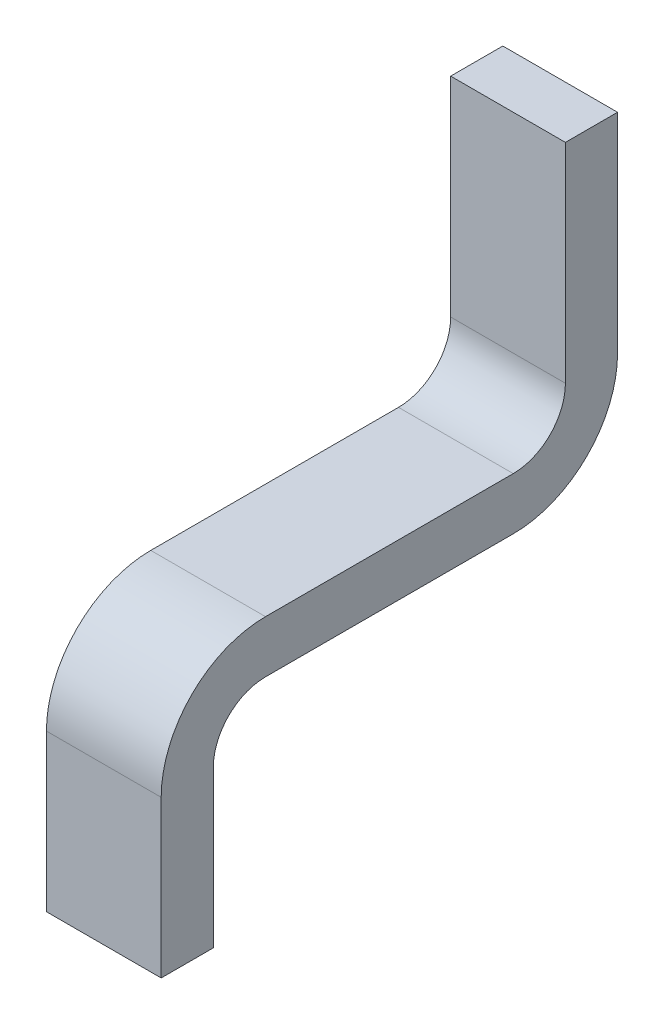
ISO-10303-21;
HEADER;
FILE_DESCRIPTION(('STEP AP214'),'2;1');
FILE_NAME('part.step','',(''),(''),'','','');
FILE_SCHEMA(('AUTOMOTIVE_DESIGN { 1 0 10303 214 1 1 1 1 }'));
ENDSEC;
DATA;
#1=APPLICATION_CONTEXT('core data for automotive mechanical design processes');
#2=APPLICATION_PROTOCOL_DEFINITION('international standard','automotive_design',2000,#1);
#3=PRODUCT_CONTEXT('',#1,'mechanical');
#4=PRODUCT('Part','Part','',(#3));
#5=PRODUCT_RELATED_PRODUCT_CATEGORY('part','',(#4));
#6=PRODUCT_DEFINITION_FORMATION('','',#4);
#7=PRODUCT_DEFINITION_CONTEXT('part definition',#1,'design');
#8=PRODUCT_DEFINITION('design','',#6,#7);
#9=PRODUCT_DEFINITION_SHAPE('','',#8);
#10=(LENGTH_UNIT() NAMED_UNIT(*) SI_UNIT(.MILLI.,.METRE.));
#11=(NAMED_UNIT(*) PLANE_ANGLE_UNIT() SI_UNIT($,.RADIAN.));
#12=(NAMED_UNIT(*) SI_UNIT($,.STERADIAN.) SOLID_ANGLE_UNIT());
#13=UNCERTAINTY_MEASURE_WITH_UNIT(LENGTH_MEASURE(1.E-05),#10,'distance_accuracy_value','');
#14=(GEOMETRIC_REPRESENTATION_CONTEXT(3) GLOBAL_UNCERTAINTY_ASSIGNED_CONTEXT((#13)) GLOBAL_UNIT_ASSIGNED_CONTEXT((#10,
#11,#12)) REPRESENTATION_CONTEXT('',''));
#15=CARTESIAN_POINT('',(0.,0.,0.));
#16=DIRECTION('',(0.,0.,1.));
#17=DIRECTION('',(1.,0.,0.));
#18=AXIS2_PLACEMENT_3D('',#15,#16,#17);
#19=CARTESIAN_POINT('',(0.36,4.,0.675));
#20=DIRECTION('',(-1.,0.,0.));
#21=DIRECTION('',(0.,-1.,0.));
#22=AXIS2_PLACEMENT_3D('',#19,#20,#21);
#23=PLANE('',#22);
#24=CARTESIAN_POINT('',(0.36,3.8,0.675));
#25=DIRECTION('',(1.,0.,0.));
#26=DIRECTION('',(0.,1.,0.));
#27=AXIS2_PLACEMENT_3D('',#24,#25,#26);
#28=CIRCLE('',#27,0.2);
#29=CARTESIAN_POINT('',(0.36,3.8,0.875));
#30=VERTEX_POINT('',#29);
#31=CARTESIAN_POINT('',(0.36,4.,0.675));
#32=VERTEX_POINT('',#31);
#33=EDGE_CURVE('E150',#30,#32,#28,.F.);
#34=ORIENTED_EDGE('',*,*,#33,.F.);
#35=DIRECTION('',(0.,1.,0.));
#36=VECTOR('',#35,1.);
#37=CARTESIAN_POINT('',(0.36,3.5,0.875));
#38=LINE('',#37,#36);
#39=CARTESIAN_POINT('',(0.36,3.5,0.875));
#40=VERTEX_POINT('',#39);
#41=EDGE_CURVE('E147',#30,#40,#38,.F.);
#42=ORIENTED_EDGE('',*,*,#41,.T.);
#43=DIRECTION('',(0.,0.,1.));
#44=VECTOR('',#43,1.);
#45=CARTESIAN_POINT('',(0.36,3.5,0.775));
#46=LINE('',#45,#44);
#47=CARTESIAN_POINT('',(0.36,3.5,0.775));
#48=VERTEX_POINT('',#47);
#49=EDGE_CURVE('E141',#48,#40,#46,.T.);
#50=ORIENTED_EDGE('',*,*,#49,.F.);
#51=DIRECTION('',(0.,1.,0.));
#52=VECTOR('',#51,1.);
#53=CARTESIAN_POINT('',(0.36,3.5,0.775));
#54=LINE('',#53,#52);
#55=CARTESIAN_POINT('',(0.36,3.8,0.775));
#56=VERTEX_POINT('',#55);
#57=EDGE_CURVE('E115',#48,#56,#54,.T.);
#58=ORIENTED_EDGE('',*,*,#57,.T.);
#59=CARTESIAN_POINT('',(0.36,3.8,0.675));
#60=DIRECTION('',(1.,0.,0.));
#61=DIRECTION('',(0.,1.,0.));
#62=AXIS2_PLACEMENT_3D('',#59,#60,#61);
#63=CIRCLE('',#62,0.1);
#64=CARTESIAN_POINT('',(0.36,3.9,0.675));
#65=VERTEX_POINT('',#64);
#66=EDGE_CURVE('E215',#56,#65,#63,.F.);
#67=ORIENTED_EDGE('',*,*,#66,.T.);
#68=DIRECTION('',(0.,0.,1.));
#69=VECTOR('',#68,1.);
#70=CARTESIAN_POINT('',(0.36,3.9,0.675));
#71=LINE('',#70,#69);
#72=CARTESIAN_POINT('',(0.36,3.9,0.2));
#73=VERTEX_POINT('',#72);
#74=EDGE_CURVE('E181',#65,#73,#71,.F.);
#75=ORIENTED_EDGE('',*,*,#74,.T.);
#76=CARTESIAN_POINT('',(0.36,4.1,0.2));
#77=DIRECTION('',(-1.,0.,0.));
#78=DIRECTION('',(0.,-1.,0.));
#79=AXIS2_PLACEMENT_3D('',#76,#77,#78);
#80=CIRCLE('',#79,0.2);
#81=CARTESIAN_POINT('',(0.36,4.1,0.));
#82=VERTEX_POINT('',#81);
#83=EDGE_CURVE('E20',#82,#73,#80,.T.);
#84=ORIENTED_EDGE('',*,*,#83,.F.);
#85=DIRECTION('',(0.,1.,0.));
#86=VECTOR('',#85,1.);
#87=CARTESIAN_POINT('',(0.36,4.1,0.));
#88=LINE('',#87,#86);
#89=CARTESIAN_POINT('',(0.36,4.5,0.));
#90=VERTEX_POINT('',#89);
#91=EDGE_CURVE('E91',#82,#90,#88,.T.);
#92=ORIENTED_EDGE('',*,*,#91,.T.);
#93=DIRECTION('',(0.,0.,1.));
#94=VECTOR('',#93,1.);
#95=CARTESIAN_POINT('',(0.36,4.5,0.));
#96=LINE('',#95,#94);
#97=CARTESIAN_POINT('',(0.36,4.5,0.1));
#98=VERTEX_POINT('',#97);
#99=EDGE_CURVE('E163',#90,#98,#96,.T.);
#100=ORIENTED_EDGE('',*,*,#99,.T.);
#101=DIRECTION('',(0.,1.,0.));
#102=VECTOR('',#101,1.);
#103=CARTESIAN_POINT('',(0.36,4.1,0.1));
#104=LINE('',#103,#102);
#105=CARTESIAN_POINT('',(0.36,4.1,0.1));
#106=VERTEX_POINT('',#105);
#107=EDGE_CURVE('E159',#98,#106,#104,.F.);
#108=ORIENTED_EDGE('',*,*,#107,.T.);
#109=CARTESIAN_POINT('',(0.36,4.1,0.2));
#110=DIRECTION('',(-1.,0.,0.));
#111=DIRECTION('',(0.,-1.,0.));
#112=AXIS2_PLACEMENT_3D('',#109,#110,#111);
#113=CIRCLE('',#112,0.1);
#114=CARTESIAN_POINT('',(0.36,4.,0.2));
#115=VERTEX_POINT('',#114);
#116=EDGE_CURVE('E155',#106,#115,#113,.T.);
#117=ORIENTED_EDGE('',*,*,#116,.T.);
#118=DIRECTION('',(0.,0.,1.));
#119=VECTOR('',#118,1.);
#120=CARTESIAN_POINT('',(0.36,4.,0.675));
#121=LINE('',#120,#119);
#122=EDGE_CURVE('E154',#115,#32,#121,.T.);
#123=ORIENTED_EDGE('',*,*,#122,.T.);
#124=EDGE_LOOP('',(#34,#42,#50,#58,#67,#75,#84,#92,#100,#108,#117,#123));
#125=FACE_BOUND('',#124,.T.);
#126=ADVANCED_FACE('F17',(#125),#23,.F.);
#127=CARTESIAN_POINT('',(0.36,4.1,0.2));
#128=DIRECTION('',(-1.,0.,0.));
#129=DIRECTION('',(0.,-1.,0.));
#130=AXIS2_PLACEMENT_3D('',#127,#128,#129);
#131=CYLINDRICAL_SURFACE('',#130,0.2);
#132=CARTESIAN_POINT('',(0.14,4.1,0.2));
#133=DIRECTION('',(-1.,0.,0.));
#134=DIRECTION('',(0.,-1.,0.));
#135=AXIS2_PLACEMENT_3D('',#132,#133,#134);
#136=CIRCLE('',#135,0.2);
#137=CARTESIAN_POINT('',(0.14,3.9,0.2));
#138=VERTEX_POINT('',#137);
#139=CARTESIAN_POINT('',(0.14,4.1,0.));
#140=VERTEX_POINT('',#139);
#141=EDGE_CURVE('E183',#138,#140,#136,.F.);
#142=ORIENTED_EDGE('',*,*,#141,.T.);
#143=DIRECTION('',(1.,0.,0.));
#144=VECTOR('',#143,1.);
#145=CARTESIAN_POINT('',(0.36,4.1,0.));
#146=LINE('',#145,#144);
#147=EDGE_CURVE('E178',#140,#82,#146,.T.);
#148=ORIENTED_EDGE('',*,*,#147,.T.);
#149=ORIENTED_EDGE('',*,*,#83,.T.);
#150=DIRECTION('',(-1.,0.,0.));
#151=VECTOR('',#150,1.);
#152=CARTESIAN_POINT('',(0.36,3.9,0.2));
#153=LINE('',#152,#151);
#154=EDGE_CURVE('E217',#73,#138,#153,.T.);
#155=ORIENTED_EDGE('',*,*,#154,.T.);
#156=EDGE_LOOP('',(#142,#148,#149,#155));
#157=FACE_BOUND('',#156,.T.);
#158=ADVANCED_FACE('F254',(#157),#131,.T.);
#159=CARTESIAN_POINT('',(0.36,4.1,0.));
#160=DIRECTION('',(0.,0.,1.));
#161=DIRECTION('',(1.,0.,0.));
#162=AXIS2_PLACEMENT_3D('',#159,#160,#161);
#163=PLANE('',#162);
#164=ORIENTED_EDGE('',*,*,#147,.F.);
#165=DIRECTION('',(0.,1.,0.));
#166=VECTOR('',#165,1.);
#167=CARTESIAN_POINT('',(0.14,3.9,0.));
#168=LINE('',#167,#166);
#169=CARTESIAN_POINT('',(0.14,4.5,0.));
#170=VERTEX_POINT('',#169);
#171=EDGE_CURVE('E170',#140,#170,#168,.T.);
#172=ORIENTED_EDGE('',*,*,#171,.T.);
#173=DIRECTION('',(1.,0.,0.));
#174=VECTOR('',#173,1.);
#175=CARTESIAN_POINT('',(0.36,4.5,0.));
#176=LINE('',#175,#174);
#177=EDGE_CURVE('E173',#170,#90,#176,.T.);
#178=ORIENTED_EDGE('',*,*,#177,.T.);
#179=ORIENTED_EDGE('',*,*,#91,.F.);
#180=EDGE_LOOP('',(#164,#172,#178,#179));
#181=FACE_BOUND('',#180,.T.);
#182=ADVANCED_FACE('F257',(#181),#163,.F.);
#183=CARTESIAN_POINT('',(0.36,4.5,0.));
#184=DIRECTION('',(0.,-1.,0.));
#185=DIRECTION('',(1.,0.,0.));
#186=AXIS2_PLACEMENT_3D('',#183,#184,#185);
#187=PLANE('',#186);
#188=DIRECTION('',(-1.,0.,0.));
#189=VECTOR('',#188,1.);
#190=CARTESIAN_POINT('',(0.14,4.5,0.1));
#191=LINE('',#190,#189);
#192=CARTESIAN_POINT('',(0.14,4.5,0.1));
#193=VERTEX_POINT('',#192);
#194=EDGE_CURVE('E160',#193,#98,#191,.F.);
#195=ORIENTED_EDGE('',*,*,#194,.T.);
#196=ORIENTED_EDGE('',*,*,#99,.F.);
#197=ORIENTED_EDGE('',*,*,#177,.F.);
#198=DIRECTION('',(0.,0.,1.));
#199=VECTOR('',#198,1.);
#200=CARTESIAN_POINT('',(0.14,4.5,0.675));
#201=LINE('',#200,#199);
#202=EDGE_CURVE('E166',#170,#193,#201,.T.);
#203=ORIENTED_EDGE('',*,*,#202,.T.);
#204=EDGE_LOOP('',(#195,#196,#197,#203));
#205=FACE_BOUND('',#204,.T.);
#206=ADVANCED_FACE('F259',(#205),#187,.F.);
#207=CARTESIAN_POINT('',(0.14,4.1,0.1));
#208=DIRECTION('',(0.,0.,-1.));
#209=DIRECTION('',(-1.,0.,0.));
#210=AXIS2_PLACEMENT_3D('',#207,#208,#209);
#211=PLANE('',#210);
#212=DIRECTION('',(-1.,0.,0.));
#213=VECTOR('',#212,1.);
#214=CARTESIAN_POINT('',(0.14,4.1,0.1));
#215=LINE('',#214,#213);
#216=CARTESIAN_POINT('',(0.14,4.1,0.1));
#217=VERTEX_POINT('',#216);
#218=EDGE_CURVE('E156',#217,#106,#215,.F.);
#219=ORIENTED_EDGE('',*,*,#218,.T.);
#220=ORIENTED_EDGE('',*,*,#107,.F.);
#221=ORIENTED_EDGE('',*,*,#194,.F.);
#222=DIRECTION('',(0.,1.,0.));
#223=VECTOR('',#222,1.);
#224=CARTESIAN_POINT('',(0.14,3.9,0.1));
#225=LINE('',#224,#223);
#226=EDGE_CURVE('E169',#193,#217,#225,.F.);
#227=ORIENTED_EDGE('',*,*,#226,.T.);
#228=EDGE_LOOP('',(#219,#220,#221,#227));
#229=FACE_BOUND('',#228,.T.);
#230=ADVANCED_FACE('F234',(#229),#211,.F.);
#231=CARTESIAN_POINT('',(0.14,4.1,0.2));
#232=DIRECTION('',(-1.,0.,0.));
#233=DIRECTION('',(0.,-1.,0.));
#234=AXIS2_PLACEMENT_3D('',#231,#232,#233);
#235=CYLINDRICAL_SURFACE('',#234,0.1);
#236=DIRECTION('',(1.,0.,0.));
#237=VECTOR('',#236,1.);
#238=CARTESIAN_POINT('',(0.14,4.,0.2));
#239=LINE('',#238,#237);
#240=CARTESIAN_POINT('',(0.14,4.,0.2));
#241=VERTEX_POINT('',#240);
#242=EDGE_CURVE('E151',#241,#115,#239,.T.);
#243=ORIENTED_EDGE('',*,*,#242,.T.);
#244=ORIENTED_EDGE('',*,*,#116,.F.);
#245=ORIENTED_EDGE('',*,*,#218,.F.);
#246=CARTESIAN_POINT('',(0.14,4.1,0.2));
#247=DIRECTION('',(-1.,0.,0.));
#248=DIRECTION('',(0.,-1.,0.));
#249=AXIS2_PLACEMENT_3D('',#246,#247,#248);
#250=CIRCLE('',#249,0.1);
#251=EDGE_CURVE('E210',#217,#241,#250,.T.);
#252=ORIENTED_EDGE('',*,*,#251,.T.);
#253=EDGE_LOOP('',(#243,#244,#245,#252));
#254=FACE_BOUND('',#253,.T.);
#255=ADVANCED_FACE('F227',(#254),#235,.F.);
#256=CARTESIAN_POINT('',(0.14,4.,0.675));
#257=DIRECTION('',(0.,-1.,0.));
#258=DIRECTION('',(1.,0.,0.));
#259=AXIS2_PLACEMENT_3D('',#256,#257,#258);
#260=PLANE('',#259);
#261=DIRECTION('',(1.,0.,0.));
#262=VECTOR('',#261,1.);
#263=CARTESIAN_POINT('',(0.14,4.,0.675));
#264=LINE('',#263,#262);
#265=CARTESIAN_POINT('',(0.14,4.,0.675));
#266=VERTEX_POINT('',#265);
#267=EDGE_CURVE('E148',#32,#266,#264,.F.);
#268=ORIENTED_EDGE('',*,*,#267,.F.);
#269=ORIENTED_EDGE('',*,*,#122,.F.);
#270=ORIENTED_EDGE('',*,*,#242,.F.);
#271=DIRECTION('',(0.,0.,1.));
#272=VECTOR('',#271,1.);
#273=CARTESIAN_POINT('',(0.14,4.,0.675));
#274=LINE('',#273,#272);
#275=EDGE_CURVE('E209',#241,#266,#274,.T.);
#276=ORIENTED_EDGE('',*,*,#275,.T.);
#277=EDGE_LOOP('',(#268,#269,#270,#276));
#278=FACE_BOUND('',#277,.T.);
#279=ADVANCED_FACE('F224',(#278),#260,.F.);
#280=CARTESIAN_POINT('',(0.14,3.8,0.675));
#281=DIRECTION('',(1.,0.,0.));
#282=DIRECTION('',(0.,1.,0.));
#283=AXIS2_PLACEMENT_3D('',#280,#281,#282);
#284=CYLINDRICAL_SURFACE('',#283,0.2);
#285=ORIENTED_EDGE('',*,*,#33,.T.);
#286=ORIENTED_EDGE('',*,*,#267,.T.);
#287=CARTESIAN_POINT('',(0.14,3.8,0.675));
#288=DIRECTION('',(1.,0.,0.));
#289=DIRECTION('',(0.,1.,0.));
#290=AXIS2_PLACEMENT_3D('',#287,#288,#289);
#291=CIRCLE('',#290,0.2);
#292=CARTESIAN_POINT('',(0.14,3.8,0.875));
#293=VERTEX_POINT('',#292);
#294=EDGE_CURVE('E133',#266,#293,#291,.T.);
#295=ORIENTED_EDGE('',*,*,#294,.T.);
#296=DIRECTION('',(-1.,0.,0.));
#297=VECTOR('',#296,1.);
#298=CARTESIAN_POINT('',(0.14,3.8,0.875));
#299=LINE('',#298,#297);
#300=EDGE_CURVE('E144',#293,#30,#299,.F.);
#301=ORIENTED_EDGE('',*,*,#300,.T.);
#302=EDGE_LOOP('',(#285,#286,#295,#301));
#303=FACE_BOUND('',#302,.T.);
#304=ADVANCED_FACE('F285',(#303),#284,.T.);
#305=CARTESIAN_POINT('',(0.14,3.5,0.875));
#306=DIRECTION('',(0.,0.,-1.));
#307=DIRECTION('',(-1.,0.,0.));
#308=AXIS2_PLACEMENT_3D('',#305,#306,#307);
#309=PLANE('',#308);
#310=DIRECTION('',(1.,0.,0.));
#311=VECTOR('',#310,1.);
#312=CARTESIAN_POINT('',(0.36,3.5,0.875));
#313=LINE('',#312,#311);
#314=CARTESIAN_POINT('',(0.14,3.5,0.875));
#315=VERTEX_POINT('',#314);
#316=EDGE_CURVE('E118',#40,#315,#313,.F.);
#317=ORIENTED_EDGE('',*,*,#316,.F.);
#318=ORIENTED_EDGE('',*,*,#41,.F.);
#319=ORIENTED_EDGE('',*,*,#300,.F.);
#320=DIRECTION('',(0.,1.,0.));
#321=VECTOR('',#320,1.);
#322=CARTESIAN_POINT('',(0.14,3.9,0.875));
#323=LINE('',#322,#321);
#324=EDGE_CURVE('E131',#293,#315,#323,.F.);
#325=ORIENTED_EDGE('',*,*,#324,.T.);
#326=EDGE_LOOP('',(#317,#318,#319,#325));
#327=FACE_BOUND('',#326,.T.);
#328=ADVANCED_FACE('F282',(#327),#309,.F.);
#329=CARTESIAN_POINT('',(0.36,3.5,0.775));
#330=DIRECTION('',(0.,-1.,0.));
#331=DIRECTION('',(1.,0.,0.));
#332=AXIS2_PLACEMENT_3D('',#329,#330,#331);
#333=PLANE('',#332);
#334=ORIENTED_EDGE('',*,*,#49,.T.);
#335=ORIENTED_EDGE('',*,*,#316,.T.);
#336=DIRECTION('',(0.,0.,1.));
#337=VECTOR('',#336,1.);
#338=CARTESIAN_POINT('',(0.14,3.5,0.675));
#339=LINE('',#338,#337);
#340=CARTESIAN_POINT('',(0.14,3.5,0.775));
#341=VERTEX_POINT('',#340);
#342=EDGE_CURVE('E125',#315,#341,#339,.F.);
#343=ORIENTED_EDGE('',*,*,#342,.T.);
#344=DIRECTION('',(1.,0.,0.));
#345=VECTOR('',#344,1.);
#346=CARTESIAN_POINT('',(0.36,3.5,0.775));
#347=LINE('',#346,#345);
#348=EDGE_CURVE('E110',#341,#48,#347,.T.);
#349=ORIENTED_EDGE('',*,*,#348,.T.);
#350=EDGE_LOOP('',(#334,#335,#343,#349));
#351=FACE_BOUND('',#350,.T.);
#352=ADVANCED_FACE('F129',(#351),#333,.T.);
#353=CARTESIAN_POINT('',(0.36,3.5,0.775));
#354=DIRECTION('',(0.,0.,1.));
#355=DIRECTION('',(1.,0.,0.));
#356=AXIS2_PLACEMENT_3D('',#353,#354,#355);
#357=PLANE('',#356);
#358=ORIENTED_EDGE('',*,*,#348,.F.);
#359=DIRECTION('',(0.,1.,0.));
#360=VECTOR('',#359,1.);
#361=CARTESIAN_POINT('',(0.14,3.9,0.775));
#362=LINE('',#361,#360);
#363=CARTESIAN_POINT('',(0.14,3.8,0.775));
#364=VERTEX_POINT('',#363);
#365=EDGE_CURVE('E114',#341,#364,#362,.T.);
#366=ORIENTED_EDGE('',*,*,#365,.T.);
#367=DIRECTION('',(1.,0.,0.));
#368=VECTOR('',#367,1.);
#369=CARTESIAN_POINT('',(0.36,3.8,0.775));
#370=LINE('',#369,#368);
#371=EDGE_CURVE('E185',#364,#56,#370,.T.);
#372=ORIENTED_EDGE('',*,*,#371,.T.);
#373=ORIENTED_EDGE('',*,*,#57,.F.);
#374=EDGE_LOOP('',(#358,#366,#372,#373));
#375=FACE_BOUND('',#374,.T.);
#376=ADVANCED_FACE('F112',(#375),#357,.F.);
#377=CARTESIAN_POINT('',(0.36,3.8,0.675));
#378=DIRECTION('',(1.,0.,0.));
#379=DIRECTION('',(0.,1.,0.));
#380=AXIS2_PLACEMENT_3D('',#377,#378,#379);
#381=CYLINDRICAL_SURFACE('',#380,0.1);
#382=ORIENTED_EDGE('',*,*,#371,.F.);
#383=CARTESIAN_POINT('',(0.14,3.8,0.675));
#384=DIRECTION('',(1.,0.,0.));
#385=DIRECTION('',(0.,1.,0.));
#386=AXIS2_PLACEMENT_3D('',#383,#384,#385);
#387=CIRCLE('',#386,0.1);
#388=CARTESIAN_POINT('',(0.14,3.9,0.675));
#389=VERTEX_POINT('',#388);
#390=EDGE_CURVE('E26',#364,#389,#387,.F.);
#391=ORIENTED_EDGE('',*,*,#390,.T.);
#392=DIRECTION('',(-1.,0.,0.));
#393=VECTOR('',#392,1.);
#394=CARTESIAN_POINT('',(0.36,3.9,0.675));
#395=LINE('',#394,#393);
#396=EDGE_CURVE('E34',#389,#65,#395,.F.);
#397=ORIENTED_EDGE('',*,*,#396,.T.);
#398=ORIENTED_EDGE('',*,*,#66,.F.);
#399=EDGE_LOOP('',(#382,#391,#397,#398));
#400=FACE_BOUND('',#399,.T.);
#401=ADVANCED_FACE('F250',(#400),#381,.F.);
#402=CARTESIAN_POINT('',(0.36,3.9,0.675));
#403=DIRECTION('',(0.,1.,0.));
#404=DIRECTION('',(-1.,0.,0.));
#405=AXIS2_PLACEMENT_3D('',#402,#403,#404);
#406=PLANE('',#405);
#407=ORIENTED_EDGE('',*,*,#396,.F.);
#408=DIRECTION('',(0.,0.,1.));
#409=VECTOR('',#408,1.);
#410=CARTESIAN_POINT('',(0.14,3.9,0.675));
#411=LINE('',#410,#409);
#412=EDGE_CURVE('E11',#389,#138,#411,.F.);
#413=ORIENTED_EDGE('',*,*,#412,.T.);
#414=ORIENTED_EDGE('',*,*,#154,.F.);
#415=ORIENTED_EDGE('',*,*,#74,.F.);
#416=EDGE_LOOP('',(#407,#413,#414,#415));
#417=FACE_BOUND('',#416,.T.);
#418=ADVANCED_FACE('F252',(#417),#406,.F.);
#419=CARTESIAN_POINT('',(0.14,3.9,0.675));
#420=DIRECTION('',(1.,0.,0.));
#421=DIRECTION('',(0.,1.,0.));
#422=AXIS2_PLACEMENT_3D('',#419,#420,#421);
#423=PLANE('',#422);
#424=ORIENTED_EDGE('',*,*,#390,.F.);
#425=ORIENTED_EDGE('',*,*,#365,.F.);
#426=ORIENTED_EDGE('',*,*,#342,.F.);
#427=ORIENTED_EDGE('',*,*,#324,.F.);
#428=ORIENTED_EDGE('',*,*,#294,.F.);
#429=ORIENTED_EDGE('',*,*,#275,.F.);
#430=ORIENTED_EDGE('',*,*,#251,.F.);
#431=ORIENTED_EDGE('',*,*,#226,.F.);
#432=ORIENTED_EDGE('',*,*,#202,.F.);
#433=ORIENTED_EDGE('',*,*,#171,.F.);
#434=ORIENTED_EDGE('',*,*,#141,.F.);
#435=ORIENTED_EDGE('',*,*,#412,.F.);
#436=EDGE_LOOP('',(#424,#425,#426,#427,#428,#429,#430,#431,#432,#433,#434,#435));
#437=FACE_BOUND('',#436,.T.);
#438=ADVANCED_FACE('F123',(#437),#423,.F.);
#439=CLOSED_SHELL('',(#126,#158,#182,#206,#230,#255,#279,#304,#328,#352,#376,#401,#418,#438));
#440=MANIFOLD_SOLID_BREP('B1',#439);
#441=ADVANCED_BREP_SHAPE_REPRESENTATION('',(#18,#440),#14);
#442=SHAPE_DEFINITION_REPRESENTATION(#9,#441);
ENDSEC;
END-ISO-10303-21;
